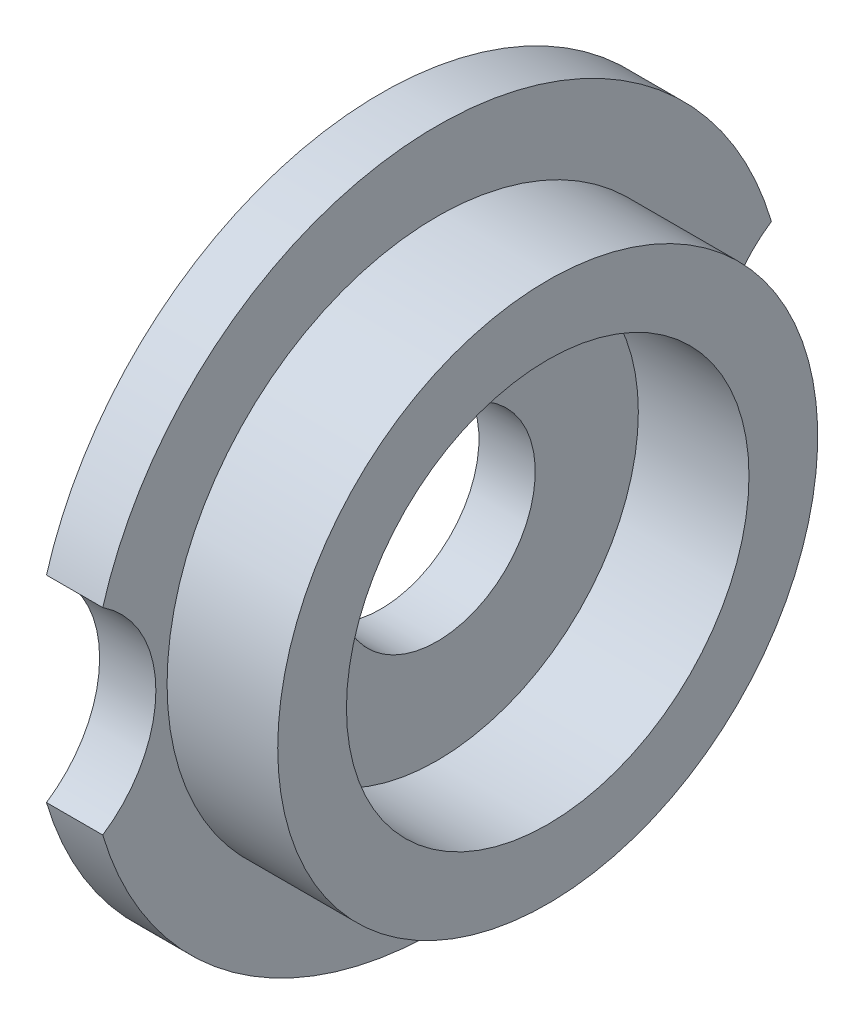
ISO-10303-21;
HEADER;
FILE_DESCRIPTION(('STEP AP214'),'2;1');
FILE_NAME('part.step','',(''),(''),'','','');
FILE_SCHEMA(('AUTOMOTIVE_DESIGN { 1 0 10303 214 1 1 1 1 }'));
ENDSEC;
DATA;
#1=APPLICATION_CONTEXT('core data for automotive mechanical design processes');
#2=APPLICATION_PROTOCOL_DEFINITION('international standard','automotive_design',2000,#1);
#3=PRODUCT_CONTEXT('',#1,'mechanical');
#4=PRODUCT('Part','Part','',(#3));
#5=PRODUCT_RELATED_PRODUCT_CATEGORY('part','',(#4));
#6=PRODUCT_DEFINITION_FORMATION('','',#4);
#7=PRODUCT_DEFINITION_CONTEXT('part definition',#1,'design');
#8=PRODUCT_DEFINITION('design','',#6,#7);
#9=PRODUCT_DEFINITION_SHAPE('','',#8);
#10=(LENGTH_UNIT() NAMED_UNIT(*) SI_UNIT(.MILLI.,.METRE.));
#11=(NAMED_UNIT(*) PLANE_ANGLE_UNIT() SI_UNIT($,.RADIAN.));
#12=(NAMED_UNIT(*) SI_UNIT($,.STERADIAN.) SOLID_ANGLE_UNIT());
#13=UNCERTAINTY_MEASURE_WITH_UNIT(LENGTH_MEASURE(1.E-05),#10,'distance_accuracy_value','');
#14=(GEOMETRIC_REPRESENTATION_CONTEXT(3) GLOBAL_UNCERTAINTY_ASSIGNED_CONTEXT((#13)) GLOBAL_UNIT_ASSIGNED_CONTEXT((#10,
#11,#12)) REPRESENTATION_CONTEXT('',''));
#15=CARTESIAN_POINT('',(0.,0.,0.));
#16=DIRECTION('',(0.,0.,1.));
#17=DIRECTION('',(1.,0.,0.));
#18=AXIS2_PLACEMENT_3D('',#15,#16,#17);
#19=CARTESIAN_POINT('',(-29.3879993474764,0.,0.));
#20=DIRECTION('',(-1.,0.,0.));
#21=DIRECTION('',(0.,0.,0.999999999999999));
#22=AXIS2_PLACEMENT_3D('',#19,#20,#21);
#23=CYLINDRICAL_SURFACE('',#22,17.75);
#24=CARTESIAN_POINT('',(-2.86500000000001,0.,0.));
#25=DIRECTION('',(-1.,0.,0.));
#26=DIRECTION('',(0.,0.,0.999999999999999));
#27=AXIS2_PLACEMENT_3D('',#24,#25,#26);
#28=CIRCLE('',#27,17.75);
#29=CARTESIAN_POINT('',(-2.86500000000001,-5.01539077644711,-17.0266953740158));
#30=VERTEX_POINT('',#29);
#31=CARTESIAN_POINT('',(-2.86500000000001,-5.0153907764471,17.0266953740157));
#32=VERTEX_POINT('',#31);
#33=EDGE_CURVE('E206',#30,#32,#28,.T.);
#34=ORIENTED_EDGE('',*,*,#33,.F.);
#35=DIRECTION('',(-1.,0.,0.));
#36=VECTOR('',#35,1.);
#37=CARTESIAN_POINT('',(2.135,-5.0153907764471,-17.0266953740158));
#38=LINE('',#37,#36);
#39=CARTESIAN_POINT('',(0.,-5.01539077644711,-17.0266953740158));
#40=VERTEX_POINT('',#39);
#41=EDGE_CURVE('E170',#30,#40,#38,.F.);
#42=ORIENTED_EDGE('',*,*,#41,.T.);
#43=CARTESIAN_POINT('',(0.,0.,0.));
#44=DIRECTION('',(-1.,0.,0.));
#45=DIRECTION('',(0.,0.,0.999999999999999));
#46=AXIS2_PLACEMENT_3D('',#43,#44,#45);
#47=CIRCLE('',#46,17.75);
#48=CARTESIAN_POINT('',(0.,-5.01539077644711,17.0266953740157));
#49=VERTEX_POINT('',#48);
#50=EDGE_CURVE('E208',#40,#49,#47,.T.);
#51=ORIENTED_EDGE('',*,*,#50,.T.);
#52=DIRECTION('',(-1.,0.,0.));
#53=VECTOR('',#52,1.);
#54=CARTESIAN_POINT('',(2.135,-5.01539077644712,17.0266953740157));
#55=LINE('',#54,#53);
#56=EDGE_CURVE('E195',#49,#32,#55,.T.);
#57=ORIENTED_EDGE('',*,*,#56,.T.);
#58=EDGE_LOOP('',(#34,#42,#51,#57));
#59=FACE_BOUND('',#58,.T.);
#60=ADVANCED_FACE('F154',(#59),#23,.T.);
#61=CARTESIAN_POINT('',(0.,4.25,0.));
#62=DIRECTION('',(-1.,0.,0.));
#63=DIRECTION('',(0.,0.,0.999999999999999));
#64=AXIS2_PLACEMENT_3D('',#61,#62,#63);
#65=PLANE('',#64);
#66=CARTESIAN_POINT('',(0.,0.,0.));
#67=DIRECTION('',(-1.,0.,0.));
#68=DIRECTION('',(0.,0.,0.999999999999999));
#69=AXIS2_PLACEMENT_3D('',#66,#67,#68);
#70=CIRCLE('',#69,5.);
#71=CARTESIAN_POINT('',(0.,0.,4.99999999999999));
#72=VERTEX_POINT('',#71);
#73=EDGE_CURVE('E215',#72,#72,#70,.T.);
#74=ORIENTED_EDGE('',*,*,#73,.T.);
#75=EDGE_LOOP('',(#74));
#76=FACE_BOUND('',#75,.T.);
#77=CARTESIAN_POINT('',(0.,0.,0.));
#78=DIRECTION('',(-1.,0.,0.));
#79=DIRECTION('',(0.,0.,0.999999999999999));
#80=AXIS2_PLACEMENT_3D('',#77,#78,#79);
#81=CIRCLE('',#80,10.25);
#82=CARTESIAN_POINT('',(0.,0.,10.25));
#83=VERTEX_POINT('',#82);
#84=EDGE_CURVE('E163',#83,#83,#81,.T.);
#85=ORIENTED_EDGE('',*,*,#84,.F.);
#86=EDGE_LOOP('',(#85));
#87=FACE_BOUND('',#86,.T.);
#88=ADVANCED_FACE('F156',(#76,#87),#65,.F.);
#89=CARTESIAN_POINT('',(-29.3879993474764,0.,0.));
#90=DIRECTION('',(-1.,0.,0.));
#91=DIRECTION('',(0.,0.,0.999999999999999));
#92=AXIS2_PLACEMENT_3D('',#89,#90,#91);
#93=CYLINDRICAL_SURFACE('',#92,10.25);
#94=CARTESIAN_POINT('',(5.635,0.,0.));
#95=DIRECTION('',(-1.,0.,0.));
#96=DIRECTION('',(0.,0.,0.999999999999999));
#97=AXIS2_PLACEMENT_3D('',#94,#95,#96);
#98=CIRCLE('',#97,10.25);
#99=CARTESIAN_POINT('',(5.635,0.,10.25));
#100=VERTEX_POINT('',#99);
#101=EDGE_CURVE('E237',#100,#100,#98,.T.);
#102=ORIENTED_EDGE('',*,*,#101,.F.);
#103=EDGE_LOOP('',(#102));
#104=FACE_BOUND('',#103,.T.);
#105=ORIENTED_EDGE('',*,*,#84,.T.);
#106=EDGE_LOOP('',(#105));
#107=FACE_BOUND('',#106,.T.);
#108=ADVANCED_FACE('F245',(#104,#107),#93,.F.);
#109=CARTESIAN_POINT('',(5.635,10.25,0.));
#110=DIRECTION('',(-1.,0.,0.));
#111=DIRECTION('',(0.,0.,0.999999999999999));
#112=AXIS2_PLACEMENT_3D('',#109,#110,#111);
#113=PLANE('',#112);
#114=CARTESIAN_POINT('',(5.635,0.,0.));
#115=DIRECTION('',(-1.,0.,0.));
#116=DIRECTION('',(0.,0.,0.999999999999999));
#117=AXIS2_PLACEMENT_3D('',#114,#115,#116);
#118=CIRCLE('',#117,13.75);
#119=CARTESIAN_POINT('',(5.635,0.,13.75));
#120=VERTEX_POINT('',#119);
#121=EDGE_CURVE('E233',#120,#120,#118,.T.);
#122=ORIENTED_EDGE('',*,*,#121,.F.);
#123=EDGE_LOOP('',(#122));
#124=FACE_BOUND('',#123,.T.);
#125=ORIENTED_EDGE('',*,*,#101,.T.);
#126=EDGE_LOOP('',(#125));
#127=FACE_BOUND('',#126,.T.);
#128=ADVANCED_FACE('F253',(#124,#127),#113,.F.);
#129=CARTESIAN_POINT('',(-29.3879993474764,0.,0.));
#130=DIRECTION('',(-1.,0.,0.));
#131=DIRECTION('',(0.,0.,0.999999999999999));
#132=AXIS2_PLACEMENT_3D('',#129,#130,#131);
#133=CYLINDRICAL_SURFACE('',#132,13.75);
#134=CARTESIAN_POINT('',(0.,0.,0.));
#135=DIRECTION('',(-1.,0.,0.));
#136=DIRECTION('',(0.,0.,0.999999999999999));
#137=AXIS2_PLACEMENT_3D('',#134,#135,#136);
#138=CIRCLE('',#137,13.75);
#139=CARTESIAN_POINT('',(0.,0.,13.75));
#140=VERTEX_POINT('',#139);
#141=EDGE_CURVE('E229',#140,#140,#138,.T.);
#142=ORIENTED_EDGE('',*,*,#141,.F.);
#143=EDGE_LOOP('',(#142));
#144=FACE_BOUND('',#143,.T.);
#145=ORIENTED_EDGE('',*,*,#121,.T.);
#146=EDGE_LOOP('',(#145));
#147=FACE_BOUND('',#146,.T.);
#148=ADVANCED_FACE('F279',(#144,#147),#133,.T.);
#149=CARTESIAN_POINT('',(0.,17.75,0.));
#150=DIRECTION('',(-1.,0.,0.));
#151=DIRECTION('',(0.,0.,0.999999999999999));
#152=AXIS2_PLACEMENT_3D('',#149,#150,#151);
#153=PLANE('',#152);
#154=ORIENTED_EDGE('',*,*,#50,.F.);
#155=CARTESIAN_POINT('',(0.,0.,-20.32));
#156=DIRECTION('',(-1.,0.,0.));
#157=DIRECTION('',(0.,0.,0.999999999999999));
#158=AXIS2_PLACEMENT_3D('',#155,#156,#157);
#159=CIRCLE('',#158,6.);
#160=CARTESIAN_POINT('',(0.,5.0153907764471,-17.0266953740157));
#161=VERTEX_POINT('',#160);
#162=EDGE_CURVE('E337',#40,#161,#159,.T.);
#163=ORIENTED_EDGE('',*,*,#162,.T.);
#164=CARTESIAN_POINT('',(0.,5.0153907764471,17.0266953740157));
#165=VERTEX_POINT('',#164);
#166=EDGE_CURVE('E225',#165,#161,#47,.T.);
#167=ORIENTED_EDGE('',*,*,#166,.F.);
#168=CARTESIAN_POINT('',(0.,0.,20.32));
#169=DIRECTION('',(-1.,0.,0.));
#170=DIRECTION('',(0.,0.,0.999999999999999));
#171=AXIS2_PLACEMENT_3D('',#168,#169,#170);
#172=CIRCLE('',#171,6.);
#173=EDGE_CURVE('E210',#165,#49,#172,.T.);
#174=ORIENTED_EDGE('',*,*,#173,.T.);
#175=EDGE_LOOP('',(#154,#163,#167,#174));
#176=FACE_BOUND('',#175,.T.);
#177=ORIENTED_EDGE('',*,*,#141,.T.);
#178=EDGE_LOOP('',(#177));
#179=FACE_BOUND('',#178,.T.);
#180=ADVANCED_FACE('F275',(#176,#179),#153,.F.);
#181=ORIENTED_EDGE('',*,*,#166,.T.);
#182=DIRECTION('',(-1.,0.,0.));
#183=VECTOR('',#182,1.);
#184=CARTESIAN_POINT('',(2.135,5.0153907764471,-17.0266953740157));
#185=LINE('',#184,#183);
#186=CARTESIAN_POINT('',(-2.86500000000001,5.0153907764471,-17.0266953740157));
#187=VERTEX_POINT('',#186);
#188=EDGE_CURVE('E333',#161,#187,#185,.T.);
#189=ORIENTED_EDGE('',*,*,#188,.T.);
#190=CARTESIAN_POINT('',(-2.86500000000001,5.0153907764471,17.0266953740157));
#191=VERTEX_POINT('',#190);
#192=EDGE_CURVE('E214',#191,#187,#28,.T.);
#193=ORIENTED_EDGE('',*,*,#192,.F.);
#194=DIRECTION('',(-1.,0.,0.));
#195=VECTOR('',#194,1.);
#196=CARTESIAN_POINT('',(2.135,5.01539077644709,17.0266953740157));
#197=LINE('',#196,#195);
#198=EDGE_CURVE('E177',#191,#165,#197,.F.);
#199=ORIENTED_EDGE('',*,*,#198,.T.);
#200=EDGE_LOOP('',(#181,#189,#193,#199));
#201=FACE_BOUND('',#200,.T.);
#202=ADVANCED_FACE('F256',(#201),#23,.T.);
#203=CARTESIAN_POINT('',(-2.86500000000001,4.25,0.));
#204=DIRECTION('',(1.,0.,0.));
#205=DIRECTION('',(0.,0.,-0.999999999999999));
#206=AXIS2_PLACEMENT_3D('',#203,#204,#205);
#207=PLANE('',#206);
#208=CARTESIAN_POINT('',(-2.86500000000001,0.,0.));
#209=DIRECTION('',(-1.,0.,0.));
#210=DIRECTION('',(0.,0.,0.999999999999999));
#211=AXIS2_PLACEMENT_3D('',#208,#209,#210);
#212=CIRCLE('',#211,5.);
#213=CARTESIAN_POINT('',(-2.86500000000001,0.,4.99999999999999));
#214=VERTEX_POINT('',#213);
#215=EDGE_CURVE('E221',#214,#214,#212,.T.);
#216=ORIENTED_EDGE('',*,*,#215,.F.);
#217=EDGE_LOOP('',(#216));
#218=FACE_BOUND('',#217,.T.);
#219=ORIENTED_EDGE('',*,*,#192,.T.);
#220=CARTESIAN_POINT('',(-2.86500000000001,0.,-20.32));
#221=DIRECTION('',(1.,0.,0.));
#222=DIRECTION('',(0.,0.,-0.999999999999999));
#223=AXIS2_PLACEMENT_3D('',#220,#221,#222);
#224=CIRCLE('',#223,6.);
#225=EDGE_CURVE('E12',#187,#30,#224,.T.);
#226=ORIENTED_EDGE('',*,*,#225,.T.);
#227=ORIENTED_EDGE('',*,*,#33,.T.);
#228=CARTESIAN_POINT('',(-2.86500000000001,0.,20.32));
#229=DIRECTION('',(-1.,0.,0.));
#230=DIRECTION('',(0.,0.,0.999999999999999));
#231=AXIS2_PLACEMENT_3D('',#228,#229,#230);
#232=CIRCLE('',#231,6.);
#233=EDGE_CURVE('E192',#191,#32,#232,.T.);
#234=ORIENTED_EDGE('',*,*,#233,.F.);
#235=EDGE_LOOP('',(#219,#226,#227,#234));
#236=FACE_BOUND('',#235,.T.);
#237=ADVANCED_FACE('F212',(#218,#236),#207,.F.);
#238=CARTESIAN_POINT('',(-2.86500000000001,0.,0.));
#239=DIRECTION('',(-1.,0.,0.));
#240=DIRECTION('',(0.,0.,0.999999999999999));
#241=AXIS2_PLACEMENT_3D('',#238,#239,#240);
#242=CYLINDRICAL_SURFACE('',#241,5.);
#243=ORIENTED_EDGE('',*,*,#215,.T.);
#244=EDGE_LOOP('',(#243));
#245=FACE_BOUND('',#244,.T.);
#246=ORIENTED_EDGE('',*,*,#73,.F.);
#247=EDGE_LOOP('',(#246));
#248=FACE_BOUND('',#247,.T.);
#249=ADVANCED_FACE('F259',(#245,#248),#242,.F.);
#250=CARTESIAN_POINT('',(7.135,0.,20.3199999999999));
#251=DIRECTION('',(-1.,0.,0.));
#252=DIRECTION('',(0.,0.,0.999999999999999));
#253=AXIS2_PLACEMENT_3D('',#250,#251,#252);
#254=CYLINDRICAL_SURFACE('',#253,6.);
#255=ORIENTED_EDGE('',*,*,#233,.T.);
#256=ORIENTED_EDGE('',*,*,#56,.F.);
#257=ORIENTED_EDGE('',*,*,#173,.F.);
#258=ORIENTED_EDGE('',*,*,#198,.F.);
#259=EDGE_LOOP('',(#255,#256,#257,#258));
#260=FACE_BOUND('',#259,.T.);
#261=ADVANCED_FACE('F194',(#260),#254,.F.);
#262=CARTESIAN_POINT('',(7.135,0.,-20.32));
#263=DIRECTION('',(-1.,0.,0.));
#264=DIRECTION('',(0.,0.,0.999999999999999));
#265=AXIS2_PLACEMENT_3D('',#262,#263,#264);
#266=CYLINDRICAL_SURFACE('',#265,6.);
#267=ORIENTED_EDGE('',*,*,#225,.F.);
#268=ORIENTED_EDGE('',*,*,#188,.F.);
#269=ORIENTED_EDGE('',*,*,#162,.F.);
#270=ORIENTED_EDGE('',*,*,#41,.F.);
#271=EDGE_LOOP('',(#267,#268,#269,#270));
#272=FACE_BOUND('',#271,.T.);
#273=ADVANCED_FACE('F267',(#272),#266,.F.);
#274=CLOSED_SHELL('',(#60,#88,#108,#128,#148,#180,#202,#237,#249,#261,#273));
#275=MANIFOLD_SOLID_BREP('B2',#274);
#276=ADVANCED_BREP_SHAPE_REPRESENTATION('',(#18,#275),#14);
#277=SHAPE_DEFINITION_REPRESENTATION(#9,#276);
ENDSEC;
END-ISO-10303-21;
